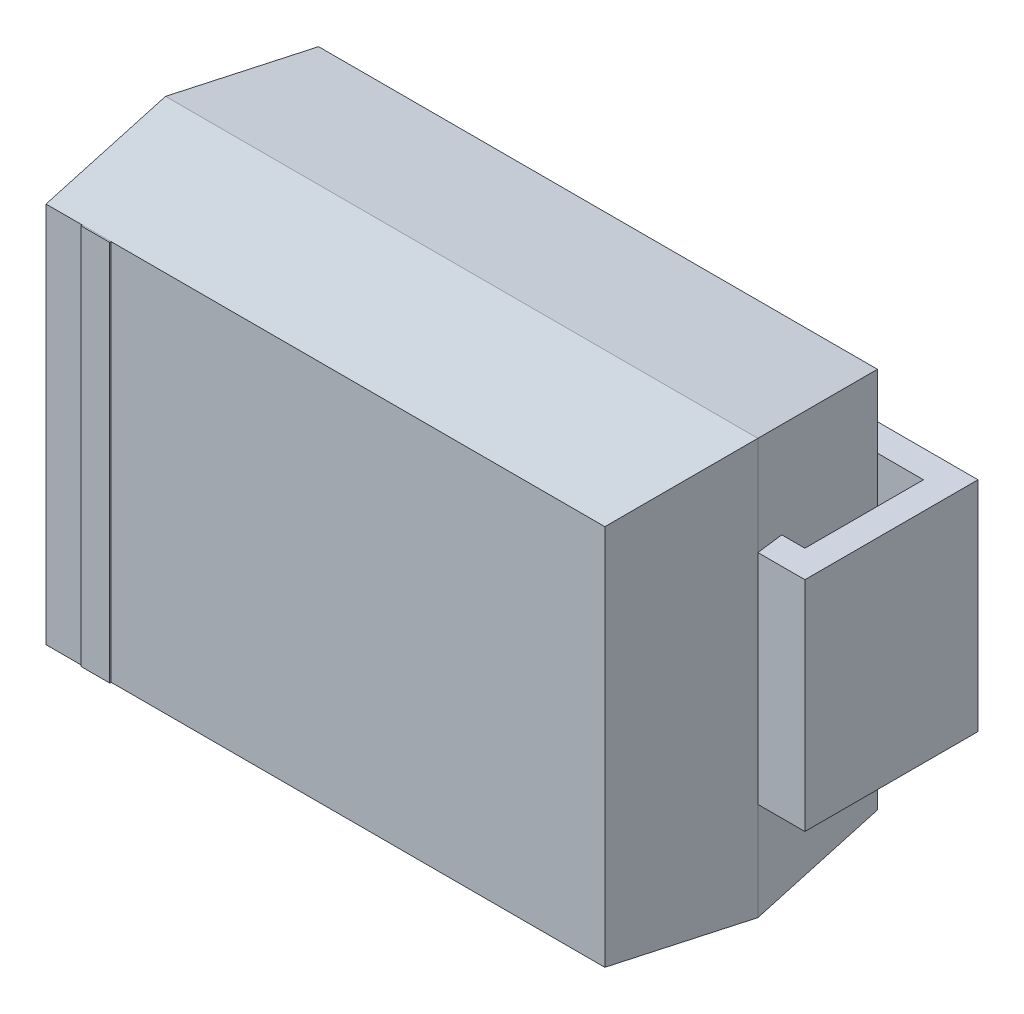
ISO-10303-21;
HEADER;
FILE_DESCRIPTION(('STEP AP214'),'2;1');
FILE_NAME('part.step','',(''),(''),'','','');
FILE_SCHEMA(('AUTOMOTIVE_DESIGN { 1 0 10303 214 1 1 1 1 }'));
ENDSEC;
DATA;
#1=APPLICATION_CONTEXT('core data for automotive mechanical design processes');
#2=APPLICATION_PROTOCOL_DEFINITION('international standard','automotive_design',2000,#1);
#3=PRODUCT_CONTEXT('',#1,'mechanical');
#4=PRODUCT('Part','Part','',(#3));
#5=PRODUCT_RELATED_PRODUCT_CATEGORY('part','',(#4));
#6=PRODUCT_DEFINITION_FORMATION('','',#4);
#7=PRODUCT_DEFINITION_CONTEXT('part definition',#1,'design');
#8=PRODUCT_DEFINITION('design','',#6,#7);
#9=PRODUCT_DEFINITION_SHAPE('','',#8);
#10=(LENGTH_UNIT() NAMED_UNIT(*) SI_UNIT(.MILLI.,.METRE.));
#11=(NAMED_UNIT(*) PLANE_ANGLE_UNIT() SI_UNIT($,.RADIAN.));
#12=(NAMED_UNIT(*) SI_UNIT($,.STERADIAN.) SOLID_ANGLE_UNIT());
#13=UNCERTAINTY_MEASURE_WITH_UNIT(LENGTH_MEASURE(1.E-05),#10,'distance_accuracy_value','');
#14=(GEOMETRIC_REPRESENTATION_CONTEXT(3) GLOBAL_UNCERTAINTY_ASSIGNED_CONTEXT((#13)) GLOBAL_UNIT_ASSIGNED_CONTEXT((#10,
#11,#12)) REPRESENTATION_CONTEXT('',''));
#15=CARTESIAN_POINT('',(0.,0.,0.));
#16=DIRECTION('',(0.,0.,1.));
#17=DIRECTION('',(1.,0.,0.));
#18=AXIS2_PLACEMENT_3D('',#15,#16,#17);
#19=CARTESIAN_POINT('',(0.,0.,1.));
#20=DIRECTION('',(0.,0.,-1.));
#21=DIRECTION('',(-1.,0.,0.));
#22=AXIS2_PLACEMENT_3D('',#19,#20,#21);
#23=PLANE('',#22);
#24=DIRECTION('',(0.,-1.,0.));
#25=VECTOR('',#24,1.);
#26=CARTESIAN_POINT('',(0.267244844076409,2.8,1.));
#27=LINE('',#26,#25);
#28=CARTESIAN_POINT('',(0.267244844076409,2.8,1.));
#29=VERTEX_POINT('',#28);
#30=CARTESIAN_POINT('',(0.267244844076409,0.,1.));
#31=VERTEX_POINT('',#30);
#32=EDGE_CURVE('E58',#29,#31,#27,.T.);
#33=ORIENTED_EDGE('',*,*,#32,.F.);
#34=DIRECTION('',(-1.,0.,0.));
#35=VECTOR('',#34,1.);
#36=CARTESIAN_POINT('',(0.,2.8,1.));
#37=LINE('',#36,#35);
#38=CARTESIAN_POINT('',(0.,2.8,1.));
#39=VERTEX_POINT('',#38);
#40=EDGE_CURVE('E267',#29,#39,#37,.T.);
#41=ORIENTED_EDGE('',*,*,#40,.T.);
#42=DIRECTION('',(0.,-1.,0.));
#43=VECTOR('',#42,1.);
#44=CARTESIAN_POINT('',(0.,0.,1.));
#45=LINE('',#44,#43);
#46=CARTESIAN_POINT('',(0.,0.,1.));
#47=VERTEX_POINT('',#46);
#48=EDGE_CURVE('E314',#39,#47,#45,.T.);
#49=ORIENTED_EDGE('',*,*,#48,.T.);
#50=DIRECTION('',(1.,0.,0.));
#51=VECTOR('',#50,1.);
#52=CARTESIAN_POINT('',(0.,0.,1.));
#53=LINE('',#52,#51);
#54=EDGE_CURVE('E299',#47,#31,#53,.T.);
#55=ORIENTED_EDGE('',*,*,#54,.T.);
#56=EDGE_LOOP('',(#33,#41,#49,#55));
#57=FACE_BOUND('',#56,.T.);
#58=ADVANCED_FACE('F41',(#57),#23,.F.);
#59=DIRECTION('',(0.,1.,0.));
#60=VECTOR('',#59,1.);
#61=CARTESIAN_POINT('',(0.477683509471168,2.8,1.));
#62=LINE('',#61,#60);
#63=CARTESIAN_POINT('',(0.477683509471168,0.,1.));
#64=VERTEX_POINT('',#63);
#65=CARTESIAN_POINT('',(0.477683509471168,2.8,1.));
#66=VERTEX_POINT('',#65);
#67=EDGE_CURVE('E66',#64,#66,#62,.T.);
#68=ORIENTED_EDGE('',*,*,#67,.F.);
#69=CARTESIAN_POINT('',(4.1,0.,1.));
#70=VERTEX_POINT('',#69);
#71=EDGE_CURVE('E303',#64,#70,#53,.T.);
#72=ORIENTED_EDGE('',*,*,#71,.T.);
#73=DIRECTION('',(0.,1.,0.));
#74=VECTOR('',#73,1.);
#75=CARTESIAN_POINT('',(4.1,0.,1.));
#76=LINE('',#75,#74);
#77=CARTESIAN_POINT('',(4.1,2.8,1.));
#78=VERTEX_POINT('',#77);
#79=EDGE_CURVE('E298',#70,#78,#76,.T.);
#80=ORIENTED_EDGE('',*,*,#79,.T.);
#81=EDGE_CURVE('E292',#78,#66,#37,.T.);
#82=ORIENTED_EDGE('',*,*,#81,.T.);
#83=EDGE_LOOP('',(#68,#72,#80,#82));
#84=FACE_BOUND('',#83,.T.);
#85=ADVANCED_FACE('F583',(#84),#23,.F.);
#86=CARTESIAN_POINT('',(4.1,0.,-1.));
#87=DIRECTION('',(0.992546151641322,0.,-0.121869343405148));
#88=DIRECTION('',(-0.121869343405148,0.,-0.992546151641322));
#89=AXIS2_PLACEMENT_3D('',#86,#87,#88);
#90=PLANE('',#89);
#91=DIRECTION('',(0.,1.,0.));
#92=VECTOR('',#91,1.);
#93=CARTESIAN_POINT('',(4.2227845609029,0.,0.));
#94=LINE('',#93,#92);
#95=CARTESIAN_POINT('',(4.2227845609029,2.197,0.));
#96=VERTEX_POINT('',#95);
#97=CARTESIAN_POINT('',(4.2227845609029,2.9227845609029,0.));
#98=VERTEX_POINT('',#97);
#99=EDGE_CURVE('E333',#96,#98,#94,.T.);
#100=ORIENTED_EDGE('',*,*,#99,.F.);
#101=DIRECTION('',(-0.121869343405148,0.,-0.992546151641322));
#102=VECTOR('',#101,1.);
#103=CARTESIAN_POINT('',(4.1,2.197,-1.));
#104=LINE('',#103,#102);
#105=CARTESIAN_POINT('',(4.19822764872232,2.197,-0.2));
#106=VERTEX_POINT('',#105);
#107=EDGE_CURVE('E11',#96,#106,#104,.T.);
#108=ORIENTED_EDGE('',*,*,#107,.T.);
#109=DIRECTION('',(0.,1.,0.));
#110=VECTOR('',#109,1.);
#111=CARTESIAN_POINT('',(4.19822764872232,0.,-0.2));
#112=LINE('',#111,#110);
#113=CARTESIAN_POINT('',(4.19822764872232,0.597,-0.2));
#114=VERTEX_POINT('',#113);
#115=EDGE_CURVE('E50',#114,#106,#112,.T.);
#116=ORIENTED_EDGE('',*,*,#115,.F.);
#117=DIRECTION('',(-0.121869343405148,0.,-0.992546151641322));
#118=VECTOR('',#117,1.);
#119=CARTESIAN_POINT('',(4.1,0.597,-1.));
#120=LINE('',#119,#118);
#121=CARTESIAN_POINT('',(4.2227845609029,0.597,0.));
#122=VERTEX_POINT('',#121);
#123=EDGE_CURVE('E318',#122,#114,#120,.T.);
#124=ORIENTED_EDGE('',*,*,#123,.F.);
#125=CARTESIAN_POINT('',(4.2227845609029,-0.122784560902905,0.));
#126=VERTEX_POINT('',#125);
#127=EDGE_CURVE('E328',#126,#122,#94,.T.);
#128=ORIENTED_EDGE('',*,*,#127,.F.);
#129=DIRECTION('',(0.120974291151355,-0.120974291151355,0.985256536015293));
#130=VECTOR('',#129,1.);
#131=CARTESIAN_POINT('',(4.03999740560975,0.0600025943902483,-1.48868191529143));
#132=LINE('',#131,#130);
#133=CARTESIAN_POINT('',(4.1,0.,-1.));
#134=VERTEX_POINT('',#133);
#135=EDGE_CURVE('E341',#134,#126,#132,.T.);
#136=ORIENTED_EDGE('',*,*,#135,.F.);
#137=DIRECTION('',(0.,1.,0.));
#138=VECTOR('',#137,1.);
#139=CARTESIAN_POINT('',(4.1,0.,-1.));
#140=LINE('',#139,#138);
#141=CARTESIAN_POINT('',(4.1,2.8,-1.));
#142=VERTEX_POINT('',#141);
#143=EDGE_CURVE('E368',#134,#142,#140,.T.);
#144=ORIENTED_EDGE('',*,*,#143,.T.);
#145=DIRECTION('',(0.120974291151355,0.120974291151355,0.985256536015293));
#146=VECTOR('',#145,1.);
#147=CARTESIAN_POINT('',(4.0590226184652,2.7590226184652,-1.33373399093073));
#148=LINE('',#147,#146);
#149=EDGE_CURVE('E337',#142,#98,#148,.T.);
#150=ORIENTED_EDGE('',*,*,#149,.T.);
#151=EDGE_LOOP('',(#100,#108,#116,#124,#128,#136,#144,#150));
#152=FACE_BOUND('',#151,.T.);
#153=ADVANCED_FACE('F516',(#152),#90,.T.);
#154=CARTESIAN_POINT('',(0.,0.,-1.));
#155=DIRECTION('',(-0.992546151641322,0.,-0.121869343405148));
#156=DIRECTION('',(-0.121869343405148,0.,0.992546151641322));
#157=AXIS2_PLACEMENT_3D('',#154,#155,#156);
#158=PLANE('',#157);
#159=DIRECTION('',(0.,1.,0.));
#160=VECTOR('',#159,1.);
#161=CARTESIAN_POINT('',(-0.0982276487223239,0.,-0.2));
#162=LINE('',#161,#160);
#163=CARTESIAN_POINT('',(-0.0982276487223239,0.597,-0.2));
#164=VERTEX_POINT('',#163);
#165=CARTESIAN_POINT('',(-0.0982276487223239,2.197,-0.2));
#166=VERTEX_POINT('',#165);
#167=EDGE_CURVE('E323',#164,#166,#162,.T.);
#168=ORIENTED_EDGE('',*,*,#167,.T.);
#169=DIRECTION('',(-0.121869343405148,0.,0.992546151641322));
#170=VECTOR('',#169,1.);
#171=CARTESIAN_POINT('',(0.,2.197,-1.));
#172=LINE('',#171,#170);
#173=CARTESIAN_POINT('',(-0.122784560902905,2.197,0.));
#174=VERTEX_POINT('',#173);
#175=EDGE_CURVE('E321',#166,#174,#172,.T.);
#176=ORIENTED_EDGE('',*,*,#175,.T.);
#177=DIRECTION('',(0.,1.,0.));
#178=VECTOR('',#177,1.);
#179=CARTESIAN_POINT('',(-0.122784560902905,0.,0.));
#180=LINE('',#179,#178);
#181=CARTESIAN_POINT('',(-0.122784560902905,2.9227845609029,0.));
#182=VERTEX_POINT('',#181);
#183=EDGE_CURVE('E353',#182,#174,#180,.F.);
#184=ORIENTED_EDGE('',*,*,#183,.F.);
#185=DIRECTION('',(-0.120974291151355,0.120974291151355,0.985256536015293));
#186=VECTOR('',#185,1.);
#187=CARTESIAN_POINT('',(0.,2.8,-1.));
#188=LINE('',#187,#186);
#189=CARTESIAN_POINT('',(0.,2.8,-1.));
#190=VERTEX_POINT('',#189);
#191=EDGE_CURVE('E340',#190,#182,#188,.T.);
#192=ORIENTED_EDGE('',*,*,#191,.F.);
#193=DIRECTION('',(0.,-1.,0.));
#194=VECTOR('',#193,1.);
#195=CARTESIAN_POINT('',(0.,0.,-1.));
#196=LINE('',#195,#194);
#197=CARTESIAN_POINT('',(0.,0.,-1.));
#198=VERTEX_POINT('',#197);
#199=EDGE_CURVE('E336',#190,#198,#196,.T.);
#200=ORIENTED_EDGE('',*,*,#199,.T.);
#201=DIRECTION('',(-0.120974291151355,-0.120974291151355,0.985256536015293));
#202=VECTOR('',#201,1.);
#203=CARTESIAN_POINT('',(0.,0.,-1.));
#204=LINE('',#203,#202);
#205=CARTESIAN_POINT('',(-0.122784560902905,-0.122784560902905,0.));
#206=VERTEX_POINT('',#205);
#207=EDGE_CURVE('E344',#198,#206,#204,.T.);
#208=ORIENTED_EDGE('',*,*,#207,.T.);
#209=CARTESIAN_POINT('',(-0.122784560902905,0.597,0.));
#210=VERTEX_POINT('',#209);
#211=EDGE_CURVE('E350',#210,#206,#180,.F.);
#212=ORIENTED_EDGE('',*,*,#211,.F.);
#213=DIRECTION('',(-0.121869343405148,0.,0.992546151641322));
#214=VECTOR('',#213,1.);
#215=CARTESIAN_POINT('',(0.,0.597,-1.));
#216=LINE('',#215,#214);
#217=EDGE_CURVE('E325',#164,#210,#216,.T.);
#218=ORIENTED_EDGE('',*,*,#217,.F.);
#219=EDGE_LOOP('',(#168,#176,#184,#192,#200,#208,#212,#218));
#220=FACE_BOUND('',#219,.T.);
#221=ADVANCED_FACE('F533',(#220),#158,.T.);
#222=CARTESIAN_POINT('',(0.,0.,1.));
#223=DIRECTION('',(-0.992546151641322,0.,0.121869343405148));
#224=DIRECTION('',(0.121869343405148,0.,0.992546151641322));
#225=AXIS2_PLACEMENT_3D('',#222,#223,#224);
#226=PLANE('',#225);
#227=ORIENTED_EDGE('',*,*,#183,.T.);
#228=EDGE_CURVE('E356',#174,#210,#180,.F.);
#229=ORIENTED_EDGE('',*,*,#228,.T.);
#230=ORIENTED_EDGE('',*,*,#211,.T.);
#231=DIRECTION('',(-0.120974291151355,-0.120974291151355,-0.985256536015293));
#232=VECTOR('',#231,1.);
#233=CARTESIAN_POINT('',(0.,0.,1.));
#234=LINE('',#233,#232);
#235=EDGE_CURVE('E310',#47,#206,#234,.T.);
#236=ORIENTED_EDGE('',*,*,#235,.F.);
#237=ORIENTED_EDGE('',*,*,#48,.F.);
#238=DIRECTION('',(-0.120974291151355,0.120974291151355,-0.985256536015293));
#239=VECTOR('',#238,1.);
#240=CARTESIAN_POINT('',(0.0409773815348037,2.7590226184652,1.33373399093073));
#241=LINE('',#240,#239);
#242=EDGE_CURVE('E295',#39,#182,#241,.T.);
#243=ORIENTED_EDGE('',*,*,#242,.T.);
#244=EDGE_LOOP('',(#227,#229,#230,#236,#237,#243));
#245=FACE_BOUND('',#244,.T.);
#246=ADVANCED_FACE('F361',(#245),#226,.T.);
#247=CARTESIAN_POINT('',(0.,0.,1.));
#248=DIRECTION('',(0.,-0.992546151641322,0.121869343405148));
#249=DIRECTION('',(0.,-0.121869343405148,-0.992546151641322));
#250=AXIS2_PLACEMENT_3D('',#247,#248,#249);
#251=PLANE('',#250);
#252=DIRECTION('',(1.,0.,0.));
#253=VECTOR('',#252,1.);
#254=CARTESIAN_POINT('',(0.,-0.122784560902905,0.));
#255=LINE('',#254,#253);
#256=EDGE_CURVE('E331',#206,#126,#255,.T.);
#257=ORIENTED_EDGE('',*,*,#256,.T.);
#258=DIRECTION('',(0.120974291151355,-0.120974291151355,-0.985256536015293));
#259=VECTOR('',#258,1.);
#260=CARTESIAN_POINT('',(4.1,0.,1.));
#261=LINE('',#260,#259);
#262=EDGE_CURVE('E359',#70,#126,#261,.T.);
#263=ORIENTED_EDGE('',*,*,#262,.F.);
#264=ORIENTED_EDGE('',*,*,#71,.F.);
#265=DIRECTION('',(1.,0.,0.));
#266=VECTOR('',#265,1.);
#267=CARTESIAN_POINT('',(0.267244844076409,0.,1.));
#268=LINE('',#267,#266);
#269=EDGE_CURVE('E254',#31,#64,#268,.T.);
#270=ORIENTED_EDGE('',*,*,#269,.F.);
#271=ORIENTED_EDGE('',*,*,#54,.F.);
#272=ORIENTED_EDGE('',*,*,#235,.T.);
#273=EDGE_LOOP('',(#257,#263,#264,#270,#271,#272));
#274=FACE_BOUND('',#273,.T.);
#275=ADVANCED_FACE('F521',(#274),#251,.T.);
#276=CARTESIAN_POINT('',(4.1,0.,1.));
#277=DIRECTION('',(0.992546151641322,0.,0.121869343405148));
#278=DIRECTION('',(0.121869343405148,0.,-0.992546151641322));
#279=AXIS2_PLACEMENT_3D('',#276,#277,#278);
#280=PLANE('',#279);
#281=ORIENTED_EDGE('',*,*,#127,.T.);
#282=EDGE_CURVE('E332',#122,#96,#94,.T.);
#283=ORIENTED_EDGE('',*,*,#282,.T.);
#284=ORIENTED_EDGE('',*,*,#99,.T.);
#285=DIRECTION('',(0.120974291151355,0.120974291151355,-0.985256536015293));
#286=VECTOR('',#285,1.);
#287=CARTESIAN_POINT('',(4.03999740560975,2.73999740560975,1.48868191529143));
#288=LINE('',#287,#286);
#289=EDGE_CURVE('E357',#78,#98,#288,.T.);
#290=ORIENTED_EDGE('',*,*,#289,.F.);
#291=ORIENTED_EDGE('',*,*,#79,.F.);
#292=ORIENTED_EDGE('',*,*,#262,.T.);
#293=EDGE_LOOP('',(#281,#283,#284,#290,#291,#292));
#294=FACE_BOUND('',#293,.T.);
#295=ADVANCED_FACE('F518',(#294),#280,.T.);
#296=CARTESIAN_POINT('',(0.,2.8,1.));
#297=DIRECTION('',(0.,0.992546151641322,0.121869343405148));
#298=DIRECTION('',(0.,-0.121869343405148,0.992546151641322));
#299=AXIS2_PLACEMENT_3D('',#296,#297,#298);
#300=PLANE('',#299);
#301=DIRECTION('',(1.,0.,0.));
#302=VECTOR('',#301,1.);
#303=CARTESIAN_POINT('',(0.,2.9227845609029,0.));
#304=LINE('',#303,#302);
#305=EDGE_CURVE('E351',#98,#182,#304,.F.);
#306=ORIENTED_EDGE('',*,*,#305,.T.);
#307=ORIENTED_EDGE('',*,*,#242,.F.);
#308=ORIENTED_EDGE('',*,*,#40,.F.);
#309=DIRECTION('',(-1.,0.,0.));
#310=VECTOR('',#309,1.);
#311=CARTESIAN_POINT('',(0.267244844076409,2.8,1.));
#312=LINE('',#311,#310);
#313=EDGE_CURVE('E238',#66,#29,#312,.T.);
#314=ORIENTED_EDGE('',*,*,#313,.F.);
#315=ORIENTED_EDGE('',*,*,#81,.F.);
#316=ORIENTED_EDGE('',*,*,#289,.T.);
#317=EDGE_LOOP('',(#306,#307,#308,#314,#315,#316));
#318=FACE_BOUND('',#317,.T.);
#319=ADVANCED_FACE('F290',(#318),#300,.T.);
#320=CARTESIAN_POINT('',(0.,2.8,-1.));
#321=DIRECTION('',(0.,0.992546151641322,-0.121869343405148));
#322=DIRECTION('',(0.,0.121869343405148,0.992546151641322));
#323=AXIS2_PLACEMENT_3D('',#320,#321,#322);
#324=PLANE('',#323);
#325=ORIENTED_EDGE('',*,*,#305,.F.);
#326=ORIENTED_EDGE('',*,*,#149,.F.);
#327=DIRECTION('',(-1.,0.,0.));
#328=VECTOR('',#327,1.);
#329=CARTESIAN_POINT('',(0.,2.8,-1.));
#330=LINE('',#329,#328);
#331=EDGE_CURVE('E371',#142,#190,#330,.T.);
#332=ORIENTED_EDGE('',*,*,#331,.T.);
#333=ORIENTED_EDGE('',*,*,#191,.T.);
#334=EDGE_LOOP('',(#325,#326,#332,#333));
#335=FACE_BOUND('',#334,.T.);
#336=ADVANCED_FACE('F43',(#335),#324,.T.);
#337=CARTESIAN_POINT('',(0.,0.,-1.));
#338=DIRECTION('',(0.,-0.992546151641322,-0.121869343405148));
#339=DIRECTION('',(0.,0.121869343405148,-0.992546151641322));
#340=AXIS2_PLACEMENT_3D('',#337,#338,#339);
#341=PLANE('',#340);
#342=ORIENTED_EDGE('',*,*,#256,.F.);
#343=ORIENTED_EDGE('',*,*,#207,.F.);
#344=DIRECTION('',(1.,0.,0.));
#345=VECTOR('',#344,1.);
#346=CARTESIAN_POINT('',(0.,0.,-1.));
#347=LINE('',#346,#345);
#348=EDGE_CURVE('E347',#198,#134,#347,.T.);
#349=ORIENTED_EDGE('',*,*,#348,.T.);
#350=ORIENTED_EDGE('',*,*,#135,.T.);
#351=EDGE_LOOP('',(#342,#343,#349,#350));
#352=FACE_BOUND('',#351,.T.);
#353=ADVANCED_FACE('F523',(#352),#341,.T.);
#354=CARTESIAN_POINT('',(0.,0.,-1.));
#355=DIRECTION('',(0.,0.,1.));
#356=DIRECTION('',(-1.,0.,0.));
#357=AXIS2_PLACEMENT_3D('',#354,#355,#356);
#358=PLANE('',#357);
#359=ORIENTED_EDGE('',*,*,#199,.F.);
#360=ORIENTED_EDGE('',*,*,#331,.F.);
#361=ORIENTED_EDGE('',*,*,#143,.F.);
#362=ORIENTED_EDGE('',*,*,#348,.F.);
#363=EDGE_LOOP('',(#359,#360,#361,#362));
#364=FACE_BOUND('',#363,.T.);
#365=ADVANCED_FACE('F529',(#364),#358,.F.);
#366=CARTESIAN_POINT('',(-0.478384560902905,2.197,-1.07));
#367=DIRECTION('',(0.,0.,-1.));
#368=DIRECTION('',(-1.,0.,0.));
#369=AXIS2_PLACEMENT_3D('',#366,#367,#368);
#370=PLANE('',#369);
#371=DIRECTION('',(1.,0.,0.));
#372=VECTOR('',#371,1.);
#373=CARTESIAN_POINT('',(-0.478384560902905,0.597,-1.07));
#374=LINE('',#373,#372);
#375=CARTESIAN_POINT('',(-0.278384560902905,0.597,-1.07));
#376=VERTEX_POINT('',#375);
#377=CARTESIAN_POINT('',(1.0216154390971,0.597,-1.07));
#378=VERTEX_POINT('',#377);
#379=EDGE_CURVE('E411',#376,#378,#374,.T.);
#380=ORIENTED_EDGE('',*,*,#379,.T.);
#381=DIRECTION('',(0.,-1.,0.));
#382=VECTOR('',#381,1.);
#383=CARTESIAN_POINT('',(1.0216154390971,2.197,-1.07));
#384=LINE('',#383,#382);
#385=CARTESIAN_POINT('',(1.0216154390971,2.197,-1.07));
#386=VERTEX_POINT('',#385);
#387=EDGE_CURVE('E376',#386,#378,#384,.T.);
#388=ORIENTED_EDGE('',*,*,#387,.F.);
#389=DIRECTION('',(1.,0.,0.));
#390=VECTOR('',#389,1.);
#391=CARTESIAN_POINT('',(-0.478384560902905,2.197,-1.07));
#392=LINE('',#391,#390);
#393=CARTESIAN_POINT('',(-0.278384560902905,2.197,-1.07));
#394=VERTEX_POINT('',#393);
#395=EDGE_CURVE('E396',#394,#386,#392,.T.);
#396=ORIENTED_EDGE('',*,*,#395,.F.);
#397=DIRECTION('',(0.,-1.,0.));
#398=VECTOR('',#397,1.);
#399=CARTESIAN_POINT('',(-0.278384560902905,2.197,-1.07));
#400=LINE('',#399,#398);
#401=EDGE_CURVE('E389',#394,#376,#400,.T.);
#402=ORIENTED_EDGE('',*,*,#401,.T.);
#403=EDGE_LOOP('',(#380,#388,#396,#402));
#404=FACE_BOUND('',#403,.T.);
#405=ADVANCED_FACE('F555',(#404),#370,.F.);
#406=CARTESIAN_POINT('',(1.0216154390971,2.197,-1.27));
#407=DIRECTION('',(1.,0.,0.));
#408=DIRECTION('',(0.,0.,-1.));
#409=AXIS2_PLACEMENT_3D('',#406,#407,#408);
#410=PLANE('',#409);
#411=DIRECTION('',(0.,0.,1.));
#412=VECTOR('',#411,1.);
#413=CARTESIAN_POINT('',(1.0216154390971,0.597,-1.27));
#414=LINE('',#413,#412);
#415=CARTESIAN_POINT('',(1.0216154390971,0.597,-1.27));
#416=VERTEX_POINT('',#415);
#417=EDGE_CURVE('E408',#416,#378,#414,.T.);
#418=ORIENTED_EDGE('',*,*,#417,.F.);
#419=DIRECTION('',(0.,-1.,0.));
#420=VECTOR('',#419,1.);
#421=CARTESIAN_POINT('',(1.0216154390971,2.197,-1.27));
#422=LINE('',#421,#420);
#423=CARTESIAN_POINT('',(1.0216154390971,2.197,-1.27));
#424=VERTEX_POINT('',#423);
#425=EDGE_CURVE('E378',#424,#416,#422,.T.);
#426=ORIENTED_EDGE('',*,*,#425,.F.);
#427=DIRECTION('',(0.,0.,1.));
#428=VECTOR('',#427,1.);
#429=CARTESIAN_POINT('',(1.0216154390971,2.197,-1.27));
#430=LINE('',#429,#428);
#431=EDGE_CURVE('E429',#424,#386,#430,.T.);
#432=ORIENTED_EDGE('',*,*,#431,.T.);
#433=ORIENTED_EDGE('',*,*,#387,.T.);
#434=EDGE_LOOP('',(#418,#426,#432,#433));
#435=FACE_BOUND('',#434,.T.);
#436=ADVANCED_FACE('F559',(#435),#410,.T.);
#437=CARTESIAN_POINT('',(-0.478384560902905,2.197,-1.27));
#438=DIRECTION('',(0.,0.,-1.));
#439=DIRECTION('',(-1.,0.,0.));
#440=AXIS2_PLACEMENT_3D('',#437,#438,#439);
#441=PLANE('',#440);
#442=DIRECTION('',(1.,0.,0.));
#443=VECTOR('',#442,1.);
#444=CARTESIAN_POINT('',(-0.478384560902905,0.597,-1.27));
#445=LINE('',#444,#443);
#446=CARTESIAN_POINT('',(-0.478384560902905,0.597,-1.27));
#447=VERTEX_POINT('',#446);
#448=EDGE_CURVE('E405',#447,#416,#445,.T.);
#449=ORIENTED_EDGE('',*,*,#448,.F.);
#450=DIRECTION('',(0.,-1.,0.));
#451=VECTOR('',#450,1.);
#452=CARTESIAN_POINT('',(-0.478384560902905,2.197,-1.27));
#453=LINE('',#452,#451);
#454=CARTESIAN_POINT('',(-0.478384560902905,2.197,-1.27));
#455=VERTEX_POINT('',#454);
#456=EDGE_CURVE('E380',#455,#447,#453,.T.);
#457=ORIENTED_EDGE('',*,*,#456,.F.);
#458=DIRECTION('',(1.,0.,0.));
#459=VECTOR('',#458,1.);
#460=CARTESIAN_POINT('',(-0.478384560902905,2.197,-1.27));
#461=LINE('',#460,#459);
#462=EDGE_CURVE('E425',#455,#424,#461,.T.);
#463=ORIENTED_EDGE('',*,*,#462,.T.);
#464=ORIENTED_EDGE('',*,*,#425,.T.);
#465=EDGE_LOOP('',(#449,#457,#463,#464));
#466=FACE_BOUND('',#465,.T.);
#467=ADVANCED_FACE('F562',(#466),#441,.T.);
#468=CARTESIAN_POINT('',(-0.478384560902905,2.197,0.));
#469=DIRECTION('',(-1.,0.,0.));
#470=DIRECTION('',(0.,0.,1.));
#471=AXIS2_PLACEMENT_3D('',#468,#469,#470);
#472=PLANE('',#471);
#473=DIRECTION('',(0.,0.,-1.));
#474=VECTOR('',#473,1.);
#475=CARTESIAN_POINT('',(-0.478384560902905,0.597,0.));
#476=LINE('',#475,#474);
#477=CARTESIAN_POINT('',(-0.478384560902905,0.597,0.));
#478=VERTEX_POINT('',#477);
#479=EDGE_CURVE('E401',#478,#447,#476,.T.);
#480=ORIENTED_EDGE('',*,*,#479,.F.);
#481=DIRECTION('',(0.,-1.,0.));
#482=VECTOR('',#481,1.);
#483=CARTESIAN_POINT('',(-0.478384560902905,2.197,0.));
#484=LINE('',#483,#482);
#485=CARTESIAN_POINT('',(-0.478384560902905,2.197,0.));
#486=VERTEX_POINT('',#485);
#487=EDGE_CURVE('E383',#486,#478,#484,.T.);
#488=ORIENTED_EDGE('',*,*,#487,.F.);
#489=DIRECTION('',(0.,0.,-1.));
#490=VECTOR('',#489,1.);
#491=CARTESIAN_POINT('',(-0.478384560902905,2.197,0.));
#492=LINE('',#491,#490);
#493=EDGE_CURVE('E421',#486,#455,#492,.T.);
#494=ORIENTED_EDGE('',*,*,#493,.T.);
#495=ORIENTED_EDGE('',*,*,#456,.T.);
#496=EDGE_LOOP('',(#480,#488,#494,#495));
#497=FACE_BOUND('',#496,.T.);
#498=ADVANCED_FACE('F566',(#497),#472,.T.);
#499=CARTESIAN_POINT('',(-0.0856659689396815,2.197,0.));
#500=DIRECTION('',(0.,0.,1.));
#501=DIRECTION('',(1.,0.,0.));
#502=AXIS2_PLACEMENT_3D('',#499,#500,#501);
#503=PLANE('',#502);
#504=DIRECTION('',(-1.,0.,0.));
#505=VECTOR('',#504,1.);
#506=CARTESIAN_POINT('',(-0.0856659689396815,0.597,0.));
#507=LINE('',#506,#505);
#508=EDGE_CURVE('E399',#210,#478,#507,.T.);
#509=ORIENTED_EDGE('',*,*,#508,.F.);
#510=ORIENTED_EDGE('',*,*,#228,.F.);
#511=DIRECTION('',(-1.,0.,0.));
#512=VECTOR('',#511,1.);
#513=CARTESIAN_POINT('',(-0.0856659689396815,2.197,0.));
#514=LINE('',#513,#512);
#515=EDGE_CURVE('E419',#174,#486,#514,.T.);
#516=ORIENTED_EDGE('',*,*,#515,.T.);
#517=ORIENTED_EDGE('',*,*,#487,.T.);
#518=EDGE_LOOP('',(#509,#510,#516,#517));
#519=FACE_BOUND('',#518,.T.);
#520=ADVANCED_FACE('F569',(#519),#503,.T.);
#521=CARTESIAN_POINT('',(-0.0856659689396815,2.197,-0.2));
#522=DIRECTION('',(0.,0.,1.));
#523=DIRECTION('',(1.,0.,0.));
#524=AXIS2_PLACEMENT_3D('',#521,#522,#523);
#525=PLANE('',#524);
#526=ORIENTED_EDGE('',*,*,#167,.F.);
#527=DIRECTION('',(-1.,0.,0.));
#528=VECTOR('',#527,1.);
#529=CARTESIAN_POINT('',(-0.0856659689396815,0.597,-0.2));
#530=LINE('',#529,#528);
#531=CARTESIAN_POINT('',(-0.278384560902905,0.597,-0.2));
#532=VERTEX_POINT('',#531);
#533=EDGE_CURVE('E397',#164,#532,#530,.T.);
#534=ORIENTED_EDGE('',*,*,#533,.T.);
#535=DIRECTION('',(0.,-1.,0.));
#536=VECTOR('',#535,1.);
#537=CARTESIAN_POINT('',(-0.278384560902905,2.197,-0.2));
#538=LINE('',#537,#536);
#539=CARTESIAN_POINT('',(-0.278384560902905,2.197,-0.2));
#540=VERTEX_POINT('',#539);
#541=EDGE_CURVE('E386',#540,#532,#538,.T.);
#542=ORIENTED_EDGE('',*,*,#541,.F.);
#543=DIRECTION('',(-1.,0.,0.));
#544=VECTOR('',#543,1.);
#545=CARTESIAN_POINT('',(-0.0856659689396815,2.197,-0.2));
#546=LINE('',#545,#544);
#547=EDGE_CURVE('E417',#166,#540,#546,.T.);
#548=ORIENTED_EDGE('',*,*,#547,.F.);
#549=EDGE_LOOP('',(#526,#534,#542,#548));
#550=FACE_BOUND('',#549,.T.);
#551=ADVANCED_FACE('F543',(#550),#525,.F.);
#552=CARTESIAN_POINT('',(-0.278384560902905,2.197,0.));
#553=DIRECTION('',(-1.,0.,0.));
#554=DIRECTION('',(0.,0.,1.));
#555=AXIS2_PLACEMENT_3D('',#552,#553,#554);
#556=PLANE('',#555);
#557=DIRECTION('',(0.,0.,-1.));
#558=VECTOR('',#557,1.);
#559=CARTESIAN_POINT('',(-0.278384560902905,0.597,0.));
#560=LINE('',#559,#558);
#561=EDGE_CURVE('E394',#532,#376,#560,.T.);
#562=ORIENTED_EDGE('',*,*,#561,.T.);
#563=ORIENTED_EDGE('',*,*,#401,.F.);
#564=DIRECTION('',(0.,0.,-1.));
#565=VECTOR('',#564,1.);
#566=CARTESIAN_POINT('',(-0.278384560902905,2.197,0.));
#567=LINE('',#566,#565);
#568=EDGE_CURVE('E393',#540,#394,#567,.T.);
#569=ORIENTED_EDGE('',*,*,#568,.F.);
#570=ORIENTED_EDGE('',*,*,#541,.T.);
#571=EDGE_LOOP('',(#562,#563,#569,#570));
#572=FACE_BOUND('',#571,.T.);
#573=ADVANCED_FACE('F549',(#572),#556,.F.);
#574=CARTESIAN_POINT('',(0.,2.197,0.));
#575=DIRECTION('',(0.,-1.,0.));
#576=DIRECTION('',(-1.,0.,0.));
#577=AXIS2_PLACEMENT_3D('',#574,#575,#576);
#578=PLANE('',#577);
#579=ORIENTED_EDGE('',*,*,#175,.F.);
#580=ORIENTED_EDGE('',*,*,#547,.T.);
#581=ORIENTED_EDGE('',*,*,#568,.T.);
#582=ORIENTED_EDGE('',*,*,#395,.T.);
#583=ORIENTED_EDGE('',*,*,#431,.F.);
#584=ORIENTED_EDGE('',*,*,#462,.F.);
#585=ORIENTED_EDGE('',*,*,#493,.F.);
#586=ORIENTED_EDGE('',*,*,#515,.F.);
#587=EDGE_LOOP('',(#579,#580,#581,#582,#583,#584,#585,#586));
#588=FACE_BOUND('',#587,.T.);
#589=ADVANCED_FACE('F539',(#588),#578,.F.);
#590=CARTESIAN_POINT('',(0.,0.597,0.));
#591=DIRECTION('',(0.,-1.,0.));
#592=DIRECTION('',(-1.,0.,0.));
#593=AXIS2_PLACEMENT_3D('',#590,#591,#592);
#594=PLANE('',#593);
#595=ORIENTED_EDGE('',*,*,#533,.F.);
#596=ORIENTED_EDGE('',*,*,#217,.T.);
#597=ORIENTED_EDGE('',*,*,#508,.T.);
#598=ORIENTED_EDGE('',*,*,#479,.T.);
#599=ORIENTED_EDGE('',*,*,#448,.T.);
#600=ORIENTED_EDGE('',*,*,#417,.T.);
#601=ORIENTED_EDGE('',*,*,#379,.F.);
#602=ORIENTED_EDGE('',*,*,#561,.F.);
#603=EDGE_LOOP('',(#595,#596,#597,#598,#599,#600,#601,#602));
#604=FACE_BOUND('',#603,.T.);
#605=ADVANCED_FACE('F572',(#604),#594,.T.);
#606=CARTESIAN_POINT('',(4.56778456090291,2.197,-1.07));
#607=DIRECTION('',(0.,0.,1.));
#608=DIRECTION('',(1.,0.,0.));
#609=AXIS2_PLACEMENT_3D('',#606,#607,#608);
#610=PLANE('',#609);
#611=DIRECTION('',(-1.,0.,0.));
#612=VECTOR('',#611,1.);
#613=CARTESIAN_POINT('',(4.56778456090291,0.597,-1.07));
#614=LINE('',#613,#612);
#615=CARTESIAN_POINT('',(4.3677845609029,0.597,-1.07));
#616=VERTEX_POINT('',#615);
#617=CARTESIAN_POINT('',(3.06778456090291,0.597,-1.07));
#618=VERTEX_POINT('',#617);
#619=EDGE_CURVE('E241',#616,#618,#614,.T.);
#620=ORIENTED_EDGE('',*,*,#619,.F.);
#621=DIRECTION('',(0.,-1.,0.));
#622=VECTOR('',#621,1.);
#623=CARTESIAN_POINT('',(4.3677845609029,2.197,-1.07));
#624=LINE('',#623,#622);
#625=CARTESIAN_POINT('',(4.3677845609029,2.197,-1.07));
#626=VERTEX_POINT('',#625);
#627=EDGE_CURVE('E414',#626,#616,#624,.T.);
#628=ORIENTED_EDGE('',*,*,#627,.F.);
#629=DIRECTION('',(-1.,0.,0.));
#630=VECTOR('',#629,1.);
#631=CARTESIAN_POINT('',(4.56778456090291,2.197,-1.07));
#632=LINE('',#631,#630);
#633=CARTESIAN_POINT('',(3.06778456090291,2.197,-1.07));
#634=VERTEX_POINT('',#633);
#635=EDGE_CURVE('E262',#626,#634,#632,.T.);
#636=ORIENTED_EDGE('',*,*,#635,.T.);
#637=DIRECTION('',(0.,-1.,0.));
#638=VECTOR('',#637,1.);
#639=CARTESIAN_POINT('',(3.06778456090291,2.197,-1.07));
#640=LINE('',#639,#638);
#641=EDGE_CURVE('E447',#634,#618,#640,.T.);
#642=ORIENTED_EDGE('',*,*,#641,.T.);
#643=EDGE_LOOP('',(#620,#628,#636,#642));
#644=FACE_BOUND('',#643,.T.);
#645=ADVANCED_FACE('F480',(#644),#610,.T.);
#646=CARTESIAN_POINT('',(4.3677845609029,2.197,0.));
#647=DIRECTION('',(-1.,0.,0.));
#648=DIRECTION('',(0.,0.,1.));
#649=AXIS2_PLACEMENT_3D('',#646,#647,#648);
#650=PLANE('',#649);
#651=DIRECTION('',(0.,0.,-1.));
#652=VECTOR('',#651,1.);
#653=CARTESIAN_POINT('',(4.3677845609029,0.597,0.));
#654=LINE('',#653,#652);
#655=CARTESIAN_POINT('',(4.3677845609029,0.597,-0.2));
#656=VERTEX_POINT('',#655);
#657=EDGE_CURVE('E244',#656,#616,#654,.T.);
#658=ORIENTED_EDGE('',*,*,#657,.F.);
#659=DIRECTION('',(0.,-1.,0.));
#660=VECTOR('',#659,1.);
#661=CARTESIAN_POINT('',(4.3677845609029,2.197,-0.2));
#662=LINE('',#661,#660);
#663=CARTESIAN_POINT('',(4.3677845609029,2.197,-0.2));
#664=VERTEX_POINT('',#663);
#665=EDGE_CURVE('E435',#664,#656,#662,.T.);
#666=ORIENTED_EDGE('',*,*,#665,.F.);
#667=DIRECTION('',(0.,0.,-1.));
#668=VECTOR('',#667,1.);
#669=CARTESIAN_POINT('',(4.3677845609029,2.197,0.));
#670=LINE('',#669,#668);
#671=EDGE_CURVE('E471',#664,#626,#670,.T.);
#672=ORIENTED_EDGE('',*,*,#671,.T.);
#673=ORIENTED_EDGE('',*,*,#627,.T.);
#674=EDGE_LOOP('',(#658,#666,#672,#673));
#675=FACE_BOUND('',#674,.T.);
#676=ADVANCED_FACE('F498',(#675),#650,.T.);
#677=CARTESIAN_POINT('',(4.17506596893968,2.197,-0.2));
#678=DIRECTION('',(0.,0.,-1.));
#679=DIRECTION('',(-1.,0.,0.));
#680=AXIS2_PLACEMENT_3D('',#677,#678,#679);
#681=PLANE('',#680);
#682=DIRECTION('',(1.,0.,0.));
#683=VECTOR('',#682,1.);
#684=CARTESIAN_POINT('',(4.17506596893968,0.597,-0.2));
#685=LINE('',#684,#683);
#686=EDGE_CURVE('E459',#114,#656,#685,.T.);
#687=ORIENTED_EDGE('',*,*,#686,.F.);
#688=ORIENTED_EDGE('',*,*,#115,.T.);
#689=DIRECTION('',(1.,0.,0.));
#690=VECTOR('',#689,1.);
#691=CARTESIAN_POINT('',(4.17506596893968,2.197,-0.2));
#692=LINE('',#691,#690);
#693=EDGE_CURVE('E470',#106,#664,#692,.T.);
#694=ORIENTED_EDGE('',*,*,#693,.T.);
#695=ORIENTED_EDGE('',*,*,#665,.T.);
#696=EDGE_LOOP('',(#687,#688,#694,#695));
#697=FACE_BOUND('',#696,.T.);
#698=ADVANCED_FACE('F500',(#697),#681,.T.);
#699=CARTESIAN_POINT('',(4.17506596893968,2.197,0.));
#700=DIRECTION('',(0.,0.,-1.));
#701=DIRECTION('',(-1.,0.,0.));
#702=AXIS2_PLACEMENT_3D('',#699,#700,#701);
#703=PLANE('',#702);
#704=ORIENTED_EDGE('',*,*,#282,.F.);
#705=DIRECTION('',(1.,0.,0.));
#706=VECTOR('',#705,1.);
#707=CARTESIAN_POINT('',(4.17506596893968,0.597,0.));
#708=LINE('',#707,#706);
#709=CARTESIAN_POINT('',(4.56778456090291,0.597,0.));
#710=VERTEX_POINT('',#709);
#711=EDGE_CURVE('E457',#122,#710,#708,.T.);
#712=ORIENTED_EDGE('',*,*,#711,.T.);
#713=DIRECTION('',(0.,-1.,0.));
#714=VECTOR('',#713,1.);
#715=CARTESIAN_POINT('',(4.56778456090291,2.197,0.));
#716=LINE('',#715,#714);
#717=CARTESIAN_POINT('',(4.56778456090291,2.197,0.));
#718=VERTEX_POINT('',#717);
#719=EDGE_CURVE('E438',#718,#710,#716,.T.);
#720=ORIENTED_EDGE('',*,*,#719,.F.);
#721=DIRECTION('',(1.,0.,0.));
#722=VECTOR('',#721,1.);
#723=CARTESIAN_POINT('',(4.17506596893968,2.197,0.));
#724=LINE('',#723,#722);
#725=EDGE_CURVE('E468',#96,#718,#724,.T.);
#726=ORIENTED_EDGE('',*,*,#725,.F.);
#727=EDGE_LOOP('',(#704,#712,#720,#726));
#728=FACE_BOUND('',#727,.T.);
#729=ADVANCED_FACE('F506',(#728),#703,.F.);
#730=CARTESIAN_POINT('',(4.56778456090291,2.197,0.));
#731=DIRECTION('',(-1.,0.,0.));
#732=DIRECTION('',(0.,0.,1.));
#733=AXIS2_PLACEMENT_3D('',#730,#731,#732);
#734=PLANE('',#733);
#735=DIRECTION('',(0.,0.,-1.));
#736=VECTOR('',#735,1.);
#737=CARTESIAN_POINT('',(4.56778456090291,0.597,0.));
#738=LINE('',#737,#736);
#739=CARTESIAN_POINT('',(4.56778456090291,0.597,-1.27));
#740=VERTEX_POINT('',#739);
#741=EDGE_CURVE('E455',#710,#740,#738,.T.);
#742=ORIENTED_EDGE('',*,*,#741,.T.);
#743=DIRECTION('',(0.,-1.,0.));
#744=VECTOR('',#743,1.);
#745=CARTESIAN_POINT('',(4.56778456090291,2.197,-1.27));
#746=LINE('',#745,#744);
#747=CARTESIAN_POINT('',(4.56778456090291,2.197,-1.27));
#748=VERTEX_POINT('',#747);
#749=EDGE_CURVE('E441',#748,#740,#746,.T.);
#750=ORIENTED_EDGE('',*,*,#749,.F.);
#751=DIRECTION('',(0.,0.,-1.));
#752=VECTOR('',#751,1.);
#753=CARTESIAN_POINT('',(4.56778456090291,2.197,0.));
#754=LINE('',#753,#752);
#755=EDGE_CURVE('E466',#718,#748,#754,.T.);
#756=ORIENTED_EDGE('',*,*,#755,.F.);
#757=ORIENTED_EDGE('',*,*,#719,.T.);
#758=EDGE_LOOP('',(#742,#750,#756,#757));
#759=FACE_BOUND('',#758,.T.);
#760=ADVANCED_FACE('F512',(#759),#734,.F.);
#761=CARTESIAN_POINT('',(4.56778456090291,2.197,-1.27));
#762=DIRECTION('',(0.,0.,1.));
#763=DIRECTION('',(1.,0.,0.));
#764=AXIS2_PLACEMENT_3D('',#761,#762,#763);
#765=PLANE('',#764);
#766=DIRECTION('',(-1.,0.,0.));
#767=VECTOR('',#766,1.);
#768=CARTESIAN_POINT('',(4.56778456090291,0.597,-1.27));
#769=LINE('',#768,#767);
#770=CARTESIAN_POINT('',(3.06778456090291,0.597,-1.27));
#771=VERTEX_POINT('',#770);
#772=EDGE_CURVE('E453',#740,#771,#769,.T.);
#773=ORIENTED_EDGE('',*,*,#772,.T.);
#774=DIRECTION('',(0.,-1.,0.));
#775=VECTOR('',#774,1.);
#776=CARTESIAN_POINT('',(3.06778456090291,2.197,-1.27));
#777=LINE('',#776,#775);
#778=CARTESIAN_POINT('',(3.06778456090291,2.197,-1.27));
#779=VERTEX_POINT('',#778);
#780=EDGE_CURVE('E444',#779,#771,#777,.T.);
#781=ORIENTED_EDGE('',*,*,#780,.F.);
#782=DIRECTION('',(-1.,0.,0.));
#783=VECTOR('',#782,1.);
#784=CARTESIAN_POINT('',(4.56778456090291,2.197,-1.27));
#785=LINE('',#784,#783);
#786=EDGE_CURVE('E464',#748,#779,#785,.T.);
#787=ORIENTED_EDGE('',*,*,#786,.F.);
#788=ORIENTED_EDGE('',*,*,#749,.T.);
#789=EDGE_LOOP('',(#773,#781,#787,#788));
#790=FACE_BOUND('',#789,.T.);
#791=ADVANCED_FACE('F514',(#790),#765,.F.);
#792=CARTESIAN_POINT('',(3.06778456090291,2.197,-1.27));
#793=DIRECTION('',(1.,0.,0.));
#794=DIRECTION('',(0.,0.,-1.));
#795=AXIS2_PLACEMENT_3D('',#792,#793,#794);
#796=PLANE('',#795);
#797=DIRECTION('',(0.,0.,1.));
#798=VECTOR('',#797,1.);
#799=CARTESIAN_POINT('',(3.06778456090291,0.597,-1.27));
#800=LINE('',#799,#798);
#801=EDGE_CURVE('E450',#771,#618,#800,.T.);
#802=ORIENTED_EDGE('',*,*,#801,.T.);
#803=ORIENTED_EDGE('',*,*,#641,.F.);
#804=DIRECTION('',(0.,0.,1.));
#805=VECTOR('',#804,1.);
#806=CARTESIAN_POINT('',(3.06778456090291,2.197,-1.27));
#807=LINE('',#806,#805);
#808=EDGE_CURVE('E449',#779,#634,#807,.T.);
#809=ORIENTED_EDGE('',*,*,#808,.F.);
#810=ORIENTED_EDGE('',*,*,#780,.T.);
#811=EDGE_LOOP('',(#802,#803,#809,#810));
#812=FACE_BOUND('',#811,.T.);
#813=ADVANCED_FACE('F490',(#812),#796,.F.);
#814=CARTESIAN_POINT('',(4.0894,2.197,0.));
#815=DIRECTION('',(0.,-1.,0.));
#816=DIRECTION('',(1.,0.,0.));
#817=AXIS2_PLACEMENT_3D('',#814,#815,#816);
#818=PLANE('',#817);
#819=ORIENTED_EDGE('',*,*,#107,.F.);
#820=ORIENTED_EDGE('',*,*,#725,.T.);
#821=ORIENTED_EDGE('',*,*,#755,.T.);
#822=ORIENTED_EDGE('',*,*,#786,.T.);
#823=ORIENTED_EDGE('',*,*,#808,.T.);
#824=ORIENTED_EDGE('',*,*,#635,.F.);
#825=ORIENTED_EDGE('',*,*,#671,.F.);
#826=ORIENTED_EDGE('',*,*,#693,.F.);
#827=EDGE_LOOP('',(#819,#820,#821,#822,#823,#824,#825,#826));
#828=FACE_BOUND('',#827,.T.);
#829=ADVANCED_FACE('F484',(#828),#818,.F.);
#830=CARTESIAN_POINT('',(4.0894,0.597,0.));
#831=DIRECTION('',(0.,-1.,0.));
#832=DIRECTION('',(1.,0.,0.));
#833=AXIS2_PLACEMENT_3D('',#830,#831,#832);
#834=PLANE('',#833);
#835=ORIENTED_EDGE('',*,*,#711,.F.);
#836=ORIENTED_EDGE('',*,*,#123,.T.);
#837=ORIENTED_EDGE('',*,*,#686,.T.);
#838=ORIENTED_EDGE('',*,*,#657,.T.);
#839=ORIENTED_EDGE('',*,*,#619,.T.);
#840=ORIENTED_EDGE('',*,*,#801,.F.);
#841=ORIENTED_EDGE('',*,*,#772,.F.);
#842=ORIENTED_EDGE('',*,*,#741,.F.);
#843=EDGE_LOOP('',(#835,#836,#837,#838,#839,#840,#841,#842));
#844=FACE_BOUND('',#843,.T.);
#845=ADVANCED_FACE('F495',(#844),#834,.T.);
#846=CARTESIAN_POINT('',(0.267244844076409,2.8,1.01));
#847=DIRECTION('',(1.,0.,0.));
#848=DIRECTION('',(0.,0.,-1.));
#849=AXIS2_PLACEMENT_3D('',#846,#847,#848);
#850=PLANE('',#849);
#851=ORIENTED_EDGE('',*,*,#32,.T.);
#852=DIRECTION('',(0.,0.,-1.));
#853=VECTOR('',#852,1.);
#854=CARTESIAN_POINT('',(0.267244844076409,0.,1.01));
#855=LINE('',#854,#853);
#856=CARTESIAN_POINT('',(0.267244844076409,0.,1.01));
#857=VERTEX_POINT('',#856);
#858=EDGE_CURVE('E223',#857,#31,#855,.T.);
#859=ORIENTED_EDGE('',*,*,#858,.F.);
#860=DIRECTION('',(0.,-1.,0.));
#861=VECTOR('',#860,1.);
#862=CARTESIAN_POINT('',(0.267244844076409,2.8,1.01));
#863=LINE('',#862,#861);
#864=CARTESIAN_POINT('',(0.267244844076409,2.8,1.01));
#865=VERTEX_POINT('',#864);
#866=EDGE_CURVE('E229',#865,#857,#863,.T.);
#867=ORIENTED_EDGE('',*,*,#866,.F.);
#868=DIRECTION('',(0.,0.,-1.));
#869=VECTOR('',#868,1.);
#870=CARTESIAN_POINT('',(0.267244844076409,2.8,1.01));
#871=LINE('',#870,#869);
#872=EDGE_CURVE('E255',#865,#29,#871,.T.);
#873=ORIENTED_EDGE('',*,*,#872,.T.);
#874=EDGE_LOOP('',(#851,#859,#867,#873));
#875=FACE_BOUND('',#874,.T.);
#876=ADVANCED_FACE('F240',(#875),#850,.F.);
#877=CARTESIAN_POINT('',(0.267244844076409,0.,1.01));
#878=DIRECTION('',(0.,1.,0.));
#879=DIRECTION('',(0.,0.,1.));
#880=AXIS2_PLACEMENT_3D('',#877,#878,#879);
#881=PLANE('',#880);
#882=ORIENTED_EDGE('',*,*,#269,.T.);
#883=DIRECTION('',(0.,0.,-1.));
#884=VECTOR('',#883,1.);
#885=CARTESIAN_POINT('',(0.477683509471168,0.,1.01));
#886=LINE('',#885,#884);
#887=CARTESIAN_POINT('',(0.477683509471168,0.,1.01));
#888=VERTEX_POINT('',#887);
#889=EDGE_CURVE('E225',#888,#64,#886,.T.);
#890=ORIENTED_EDGE('',*,*,#889,.F.);
#891=DIRECTION('',(1.,0.,0.));
#892=VECTOR('',#891,1.);
#893=CARTESIAN_POINT('',(0.267244844076409,0.,1.01));
#894=LINE('',#893,#892);
#895=EDGE_CURVE('E218',#857,#888,#894,.T.);
#896=ORIENTED_EDGE('',*,*,#895,.F.);
#897=ORIENTED_EDGE('',*,*,#858,.T.);
#898=EDGE_LOOP('',(#882,#890,#896,#897));
#899=FACE_BOUND('',#898,.T.);
#900=ADVANCED_FACE('F221',(#899),#881,.F.);
#901=CARTESIAN_POINT('',(0.477683509471168,2.8,1.01));
#902=DIRECTION('',(-1.,0.,0.));
#903=DIRECTION('',(0.,0.,1.));
#904=AXIS2_PLACEMENT_3D('',#901,#902,#903);
#905=PLANE('',#904);
#906=ORIENTED_EDGE('',*,*,#67,.T.);
#907=DIRECTION('',(0.,0.,-1.));
#908=VECTOR('',#907,1.);
#909=CARTESIAN_POINT('',(0.477683509471168,2.8,1.01));
#910=LINE('',#909,#908);
#911=CARTESIAN_POINT('',(0.477683509471168,2.8,1.01));
#912=VERTEX_POINT('',#911);
#913=EDGE_CURVE('E246',#912,#66,#910,.T.);
#914=ORIENTED_EDGE('',*,*,#913,.F.);
#915=DIRECTION('',(0.,1.,0.));
#916=VECTOR('',#915,1.);
#917=CARTESIAN_POINT('',(0.477683509471168,2.8,1.01));
#918=LINE('',#917,#916);
#919=EDGE_CURVE('E228',#888,#912,#918,.T.);
#920=ORIENTED_EDGE('',*,*,#919,.F.);
#921=ORIENTED_EDGE('',*,*,#889,.T.);
#922=EDGE_LOOP('',(#906,#914,#920,#921));
#923=FACE_BOUND('',#922,.T.);
#924=ADVANCED_FACE('F282',(#923),#905,.F.);
#925=CARTESIAN_POINT('',(0.267244844076409,2.8,1.01));
#926=DIRECTION('',(0.,-1.,0.));
#927=DIRECTION('',(0.,0.,-1.));
#928=AXIS2_PLACEMENT_3D('',#925,#926,#927);
#929=PLANE('',#928);
#930=ORIENTED_EDGE('',*,*,#313,.T.);
#931=ORIENTED_EDGE('',*,*,#872,.F.);
#932=DIRECTION('',(-1.,0.,0.));
#933=VECTOR('',#932,1.);
#934=CARTESIAN_POINT('',(0.267244844076409,2.8,1.01));
#935=LINE('',#934,#933);
#936=EDGE_CURVE('E234',#912,#865,#935,.T.);
#937=ORIENTED_EDGE('',*,*,#936,.F.);
#938=ORIENTED_EDGE('',*,*,#913,.T.);
#939=EDGE_LOOP('',(#930,#931,#937,#938));
#940=FACE_BOUND('',#939,.T.);
#941=ADVANCED_FACE('F285',(#940),#929,.F.);
#942=CARTESIAN_POINT('',(0.,0.,1.01));
#943=DIRECTION('',(0.,0.,1.));
#944=DIRECTION('',(1.,0.,0.));
#945=AXIS2_PLACEMENT_3D('',#942,#943,#944);
#946=PLANE('',#945);
#947=ORIENTED_EDGE('',*,*,#866,.T.);
#948=ORIENTED_EDGE('',*,*,#895,.T.);
#949=ORIENTED_EDGE('',*,*,#919,.T.);
#950=ORIENTED_EDGE('',*,*,#936,.T.);
#951=EDGE_LOOP('',(#947,#948,#949,#950));
#952=FACE_BOUND('',#951,.T.);
#953=ADVANCED_FACE('F232',(#952),#946,.T.);
#954=CLOSED_SHELL('',(#58,#85,#153,#221,#246,#275,#295,#319,#336,#353,#365,#405,#436,#467,#498,
#520,#551,#573,#589,#605,#645,#676,#698,#729,#760,#791,#813,#829,#845,#876,#900,#924,#941,#953));
#955=MANIFOLD_SOLID_BREP('B2',#954);
#956=ADVANCED_BREP_SHAPE_REPRESENTATION('',(#18,#955),#14);
#957=SHAPE_DEFINITION_REPRESENTATION(#9,#956);
ENDSEC;
END-ISO-10303-21;
